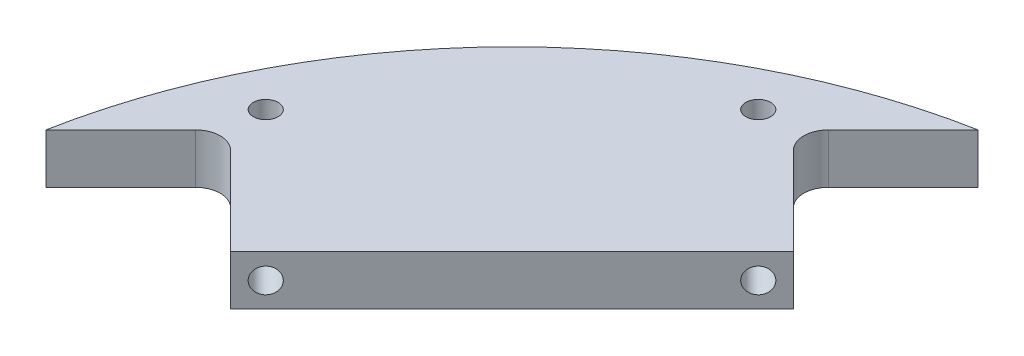
ISO-10303-21;
HEADER;
FILE_DESCRIPTION(('STEP AP214'),'2;1');
FILE_NAME('part.step','',(''),(''),'','','');
FILE_SCHEMA(('AUTOMOTIVE_DESIGN { 1 0 10303 214 1 1 1 1 }'));
ENDSEC;
DATA;
#1=APPLICATION_CONTEXT('core data for automotive mechanical design processes');
#2=APPLICATION_PROTOCOL_DEFINITION('international standard','automotive_design',2000,#1);
#3=PRODUCT_CONTEXT('',#1,'mechanical');
#4=PRODUCT('Part','Part','',(#3));
#5=PRODUCT_RELATED_PRODUCT_CATEGORY('part','',(#4));
#6=PRODUCT_DEFINITION_FORMATION('','',#4);
#7=PRODUCT_DEFINITION_CONTEXT('part definition',#1,'design');
#8=PRODUCT_DEFINITION('design','',#6,#7);
#9=PRODUCT_DEFINITION_SHAPE('','',#8);
#10=(LENGTH_UNIT() NAMED_UNIT(*) SI_UNIT(.MILLI.,.METRE.));
#11=(NAMED_UNIT(*) PLANE_ANGLE_UNIT() SI_UNIT($,.RADIAN.));
#12=(NAMED_UNIT(*) SI_UNIT($,.STERADIAN.) SOLID_ANGLE_UNIT());
#13=UNCERTAINTY_MEASURE_WITH_UNIT(LENGTH_MEASURE(1.E-05),#10,'distance_accuracy_value','');
#14=(GEOMETRIC_REPRESENTATION_CONTEXT(3) GLOBAL_UNCERTAINTY_ASSIGNED_CONTEXT((#13)) GLOBAL_UNIT_ASSIGNED_CONTEXT((#10,
#11,#12)) REPRESENTATION_CONTEXT('',''));
#15=CARTESIAN_POINT('',(0.,0.,0.));
#16=DIRECTION('',(0.,0.,1.));
#17=DIRECTION('',(1.,0.,0.));
#18=AXIS2_PLACEMENT_3D('',#15,#16,#17);
#19=CARTESIAN_POINT('',(-24.2966489706747,12.7,-96.138697939228));
#20=DIRECTION('',(0.707106781186548,0.,0.707106781186547));
#21=DIRECTION('',(0.707106781186547,0.,-0.707106781186548));
#22=AXIS2_PLACEMENT_3D('',#19,#20,#21);
#23=PLANE('',#22);
#24=CARTESIAN_POINT('',(-91.6485698786934,6.35,-28.7867770312093));
#25=DIRECTION('',(-0.707106781186548,0.,-0.707106781186547));
#26=DIRECTION('',(-0.707106781186547,0.,0.707106781186548));
#27=AXIS2_PLACEMENT_3D('',#24,#25,#26);
#28=CIRCLE('',#27,3.17499999999999);
#29=CARTESIAN_POINT('',(-93.8936339089607,6.35,-26.541713000942));
#30=VERTEX_POINT('',#29);
#31=EDGE_CURVE('E245',#30,#30,#28,.T.);
#32=ORIENTED_EDGE('',*,*,#31,.T.);
#33=EDGE_LOOP('',(#32));
#34=FACE_BOUND('',#33,.T.);
#35=DIRECTION('',(-0.707106781186547,0.,0.707106781186548));
#36=VECTOR('',#35,1.);
#37=CARTESIAN_POINT('',(-24.2966489706747,0.,-96.138697939228));
#38=LINE('',#37,#36);
#39=CARTESIAN_POINT('',(-24.2966489706747,0.,-96.138697939228));
#40=VERTEX_POINT('',#39);
#41=CARTESIAN_POINT('',(-96.1386979392279,0.,-24.2966489706747));
#42=VERTEX_POINT('',#41);
#43=EDGE_CURVE('E150',#40,#42,#38,.T.);
#44=ORIENTED_EDGE('',*,*,#43,.F.);
#45=DIRECTION('',(0.,-1.,0.));
#46=VECTOR('',#45,1.);
#47=CARTESIAN_POINT('',(-24.2966489706747,12.7,-96.138697939228));
#48=LINE('',#47,#46);
#49=CARTESIAN_POINT('',(-24.2966489706747,12.7,-96.138697939228));
#50=VERTEX_POINT('',#49);
#51=EDGE_CURVE('E112',#50,#40,#48,.T.);
#52=ORIENTED_EDGE('',*,*,#51,.F.);
#53=DIRECTION('',(-0.707106781186547,0.,0.707106781186548));
#54=VECTOR('',#53,1.);
#55=CARTESIAN_POINT('',(-24.2966489706747,12.7,-96.138697939228));
#56=LINE('',#55,#54);
#57=CARTESIAN_POINT('',(-96.1386979392279,12.7,-24.2966489706747));
#58=VERTEX_POINT('',#57);
#59=EDGE_CURVE('E137',#50,#58,#56,.T.);
#60=ORIENTED_EDGE('',*,*,#59,.T.);
#61=DIRECTION('',(0.,-1.,0.));
#62=VECTOR('',#61,1.);
#63=CARTESIAN_POINT('',(-96.1386979392279,12.7,-24.2966489706747));
#64=LINE('',#63,#62);
#65=EDGE_CURVE('E157',#58,#42,#64,.T.);
#66=ORIENTED_EDGE('',*,*,#65,.T.);
#67=EDGE_LOOP('',(#44,#52,#60,#66));
#68=FACE_BOUND('',#67,.T.);
#69=CARTESIAN_POINT('',(-28.7867770312093,6.35,-91.6485698786934));
#70=DIRECTION('',(0.707106781186548,0.,0.707106781186547));
#71=DIRECTION('',(0.707106781186547,0.,-0.707106781186548));
#72=AXIS2_PLACEMENT_3D('',#69,#70,#71);
#73=CIRCLE('',#72,3.175);
#74=CARTESIAN_POINT('',(-26.5417130009421,6.35,-93.8936339089607));
#75=VERTEX_POINT('',#74);
#76=EDGE_CURVE('E240',#75,#75,#73,.T.);
#77=ORIENTED_EDGE('',*,*,#76,.F.);
#78=EDGE_LOOP('',(#77));
#79=FACE_BOUND('',#78,.T.);
#80=ADVANCED_FACE('F36',(#34,#68,#79),#23,.T.);
#81=CARTESIAN_POINT('',(0.,12.7,0.));
#82=DIRECTION('',(0.,-1.,0.));
#83=DIRECTION('',(0.,0.,-1.));
#84=AXIS2_PLACEMENT_3D('',#81,#82,#83);
#85=PLANE('',#84);
#86=CARTESIAN_POINT('',(0.,12.7,0.));
#87=DIRECTION('',(0.,-1.,0.));
#88=DIRECTION('',(0.,0.,-1.));
#89=AXIS2_PLACEMENT_3D('',#86,#87,#88);
#90=CIRCLE('',#89,149.225);
#91=CARTESIAN_POINT('',(-146.634960986068,12.7,-27.68192265025));
#92=VERTEX_POINT('',#91);
#93=CARTESIAN_POINT('',(-27.68192265025,12.7,-146.634960986068));
#94=VERTEX_POINT('',#93);
#95=EDGE_CURVE('E120',#92,#94,#90,.T.);
#96=ORIENTED_EDGE('',*,*,#95,.F.);
#97=DIRECTION('',(0.707106781186548,0.,-0.707106781186547));
#98=VECTOR('',#97,1.);
#99=CARTESIAN_POINT('',(-146.634960986068,12.7,-27.68192265025));
#100=LINE('',#99,#98);
#101=CARTESIAN_POINT('',(-127.56959436297,12.7,-46.7472892733476));
#102=VERTEX_POINT('',#101);
#103=EDGE_CURVE('E113',#92,#102,#100,.T.);
#104=ORIENTED_EDGE('',*,*,#103,.T.);
#105=CARTESIAN_POINT('',(-123.079466302435,12.7,-42.257161212813));
#106=DIRECTION('',(0.,-1.,0.));
#107=DIRECTION('',(0.,0.,-1.));
#108=AXIS2_PLACEMENT_3D('',#105,#106,#107);
#109=CIRCLE('',#108,6.35);
#110=CARTESIAN_POINT('',(-118.589338241901,12.7,-46.7472892733476));
#111=VERTEX_POINT('',#110);
#112=EDGE_CURVE('E169',#102,#111,#109,.T.);
#113=ORIENTED_EDGE('',*,*,#112,.T.);
#114=DIRECTION('',(-0.707106781186547,0.,-0.707106781186548));
#115=VECTOR('',#114,1.);
#116=CARTESIAN_POINT('',(-96.1386979392279,12.7,-24.2966489706747));
#117=LINE('',#116,#115);
#118=EDGE_CURVE('E140',#58,#111,#117,.T.);
#119=ORIENTED_EDGE('',*,*,#118,.F.);
#120=ORIENTED_EDGE('',*,*,#59,.F.);
#121=DIRECTION('',(-0.707106781186548,0.,-0.707106781186547));
#122=VECTOR('',#121,1.);
#123=CARTESIAN_POINT('',(-24.2966489706747,12.7,-96.138697939228));
#124=LINE('',#123,#122);
#125=CARTESIAN_POINT('',(-46.7472892733476,12.7,-118.589338241901));
#126=VERTEX_POINT('',#125);
#127=EDGE_CURVE('E122',#50,#126,#124,.T.);
#128=ORIENTED_EDGE('',*,*,#127,.T.);
#129=CARTESIAN_POINT('',(-42.2571612128131,12.7,-123.079466302435));
#130=DIRECTION('',(0.,-1.,0.));
#131=DIRECTION('',(0.,0.,-1.));
#132=AXIS2_PLACEMENT_3D('',#129,#130,#131);
#133=CIRCLE('',#132,6.35);
#134=CARTESIAN_POINT('',(-46.7472892733477,12.7,-127.56959436297));
#135=VERTEX_POINT('',#134);
#136=EDGE_CURVE('E11',#126,#135,#133,.T.);
#137=ORIENTED_EDGE('',*,*,#136,.T.);
#138=DIRECTION('',(-0.707106781186547,0.,0.707106781186548));
#139=VECTOR('',#138,1.);
#140=CARTESIAN_POINT('',(-27.68192265025,12.7,-146.634960986068));
#141=LINE('',#140,#139);
#142=EDGE_CURVE('E105',#94,#135,#141,.T.);
#143=ORIENTED_EDGE('',*,*,#142,.F.);
#144=EDGE_LOOP('',(#96,#104,#113,#119,#120,#128,#137,#143));
#145=FACE_BOUND('',#144,.T.);
#146=CARTESIAN_POINT('',(-123.079466302435,12.7,-60.2176734549513));
#147=DIRECTION('',(0.,1.,0.));
#148=DIRECTION('',(0.,0.,1.));
#149=AXIS2_PLACEMENT_3D('',#146,#147,#148);
#150=CIRCLE('',#149,3.175);
#151=CARTESIAN_POINT('',(-123.079466302435,12.7,-57.0426734549513));
#152=VERTEX_POINT('',#151);
#153=EDGE_CURVE('E235',#152,#152,#150,.F.);
#154=ORIENTED_EDGE('',*,*,#153,.T.);
#155=EDGE_LOOP('',(#154));
#156=FACE_BOUND('',#155,.T.);
#157=CARTESIAN_POINT('',(-60.2176734549514,12.7,-123.079466302435));
#158=DIRECTION('',(0.,1.,0.));
#159=DIRECTION('',(0.,0.,1.));
#160=AXIS2_PLACEMENT_3D('',#157,#158,#159);
#161=CIRCLE('',#160,3.175);
#162=CARTESIAN_POINT('',(-60.2176734549514,12.7,-119.904466302435));
#163=VERTEX_POINT('',#162);
#164=EDGE_CURVE('E238',#163,#163,#161,.T.);
#165=ORIENTED_EDGE('',*,*,#164,.F.);
#166=EDGE_LOOP('',(#165));
#167=FACE_BOUND('',#166,.T.);
#168=ADVANCED_FACE('F117',(#145,#156,#167),#85,.F.);
#169=CARTESIAN_POINT('',(0.,0.,0.));
#170=DIRECTION('',(0.,-1.,0.));
#171=DIRECTION('',(0.,0.,-1.));
#172=AXIS2_PLACEMENT_3D('',#169,#170,#171);
#173=PLANE('',#172);
#174=CARTESIAN_POINT('',(-123.079466302435,0.,-60.2176734549513));
#175=DIRECTION('',(0.,1.,0.));
#176=DIRECTION('',(0.,0.,1.));
#177=AXIS2_PLACEMENT_3D('',#174,#175,#176);
#178=CIRCLE('',#177,3.175);
#179=CARTESIAN_POINT('',(-123.079466302435,0.,-57.0426734549513));
#180=VERTEX_POINT('',#179);
#181=EDGE_CURVE('E133',#180,#180,#178,.F.);
#182=ORIENTED_EDGE('',*,*,#181,.F.);
#183=EDGE_LOOP('',(#182));
#184=FACE_BOUND('',#183,.T.);
#185=CARTESIAN_POINT('',(0.,0.,0.));
#186=DIRECTION('',(0.,-1.,0.));
#187=DIRECTION('',(0.,0.,-1.));
#188=AXIS2_PLACEMENT_3D('',#185,#186,#187);
#189=CIRCLE('',#188,149.225);
#190=CARTESIAN_POINT('',(-146.634960986068,0.,-27.68192265025));
#191=VERTEX_POINT('',#190);
#192=CARTESIAN_POINT('',(-27.68192265025,0.,-146.634960986068));
#193=VERTEX_POINT('',#192);
#194=EDGE_CURVE('E144',#191,#193,#189,.T.);
#195=ORIENTED_EDGE('',*,*,#194,.T.);
#196=DIRECTION('',(-0.707106781186547,0.,0.707106781186548));
#197=VECTOR('',#196,1.);
#198=CARTESIAN_POINT('',(-27.68192265025,0.,-146.634960986068));
#199=LINE('',#198,#197);
#200=CARTESIAN_POINT('',(-46.7472892733477,0.,-127.56959436297));
#201=VERTEX_POINT('',#200);
#202=EDGE_CURVE('E107',#193,#201,#199,.T.);
#203=ORIENTED_EDGE('',*,*,#202,.T.);
#204=CARTESIAN_POINT('',(-42.2571612128131,0.,-123.079466302435));
#205=DIRECTION('',(0.,-1.,0.));
#206=DIRECTION('',(0.,0.,-1.));
#207=AXIS2_PLACEMENT_3D('',#204,#205,#206);
#208=CIRCLE('',#207,6.35);
#209=CARTESIAN_POINT('',(-46.7472892733476,0.,-118.589338241901));
#210=VERTEX_POINT('',#209);
#211=EDGE_CURVE('E44',#201,#210,#208,.F.);
#212=ORIENTED_EDGE('',*,*,#211,.T.);
#213=DIRECTION('',(-0.707106781186548,0.,-0.707106781186547));
#214=VECTOR('',#213,1.);
#215=CARTESIAN_POINT('',(-24.2966489706747,0.,-96.138697939228));
#216=LINE('',#215,#214);
#217=EDGE_CURVE('E148',#40,#210,#216,.T.);
#218=ORIENTED_EDGE('',*,*,#217,.F.);
#219=ORIENTED_EDGE('',*,*,#43,.T.);
#220=DIRECTION('',(-0.707106781186547,0.,-0.707106781186548));
#221=VECTOR('',#220,1.);
#222=CARTESIAN_POINT('',(-96.1386979392279,0.,-24.2966489706747));
#223=LINE('',#222,#221);
#224=CARTESIAN_POINT('',(-118.589338241901,0.,-46.7472892733476));
#225=VERTEX_POINT('',#224);
#226=EDGE_CURVE('E130',#42,#225,#223,.T.);
#227=ORIENTED_EDGE('',*,*,#226,.T.);
#228=CARTESIAN_POINT('',(-123.079466302435,0.,-42.257161212813));
#229=DIRECTION('',(0.,-1.,0.));
#230=DIRECTION('',(0.,0.,-1.));
#231=AXIS2_PLACEMENT_3D('',#228,#229,#230);
#232=CIRCLE('',#231,6.35);
#233=CARTESIAN_POINT('',(-127.56959436297,0.,-46.7472892733476));
#234=VERTEX_POINT('',#233);
#235=EDGE_CURVE('E167',#225,#234,#232,.F.);
#236=ORIENTED_EDGE('',*,*,#235,.T.);
#237=DIRECTION('',(0.707106781186548,0.,-0.707106781186547));
#238=VECTOR('',#237,1.);
#239=CARTESIAN_POINT('',(-146.634960986068,0.,-27.68192265025));
#240=LINE('',#239,#238);
#241=EDGE_CURVE('E127',#191,#234,#240,.T.);
#242=ORIENTED_EDGE('',*,*,#241,.F.);
#243=EDGE_LOOP('',(#195,#203,#212,#218,#219,#227,#236,#242));
#244=FACE_BOUND('',#243,.T.);
#245=CARTESIAN_POINT('',(-60.2176734549514,0.,-123.079466302435));
#246=DIRECTION('',(0.,1.,0.));
#247=DIRECTION('',(0.,0.,1.));
#248=AXIS2_PLACEMENT_3D('',#245,#246,#247);
#249=CIRCLE('',#248,3.175);
#250=CARTESIAN_POINT('',(-60.2176734549514,0.,-119.904466302435));
#251=VERTEX_POINT('',#250);
#252=EDGE_CURVE('E146',#251,#251,#249,.T.);
#253=ORIENTED_EDGE('',*,*,#252,.T.);
#254=EDGE_LOOP('',(#253));
#255=FACE_BOUND('',#254,.T.);
#256=ADVANCED_FACE('F181',(#184,#244,#255),#173,.T.);
#257=CARTESIAN_POINT('',(0.,12.7,0.));
#258=DIRECTION('',(0.,-1.,0.));
#259=DIRECTION('',(0.,0.,-1.));
#260=AXIS2_PLACEMENT_3D('',#257,#258,#259);
#261=CYLINDRICAL_SURFACE('',#260,149.225);
#262=ORIENTED_EDGE('',*,*,#194,.F.);
#263=DIRECTION('',(0.,-1.,0.));
#264=VECTOR('',#263,1.);
#265=CARTESIAN_POINT('',(-146.634960986068,12.7,-27.68192265025));
#266=LINE('',#265,#264);
#267=EDGE_CURVE('E125',#92,#191,#266,.T.);
#268=ORIENTED_EDGE('',*,*,#267,.F.);
#269=ORIENTED_EDGE('',*,*,#95,.T.);
#270=DIRECTION('',(0.,-1.,0.));
#271=VECTOR('',#270,1.);
#272=CARTESIAN_POINT('',(-27.68192265025,12.7,-146.634960986068));
#273=LINE('',#272,#271);
#274=EDGE_CURVE('E101',#94,#193,#273,.T.);
#275=ORIENTED_EDGE('',*,*,#274,.T.);
#276=EDGE_LOOP('',(#262,#268,#269,#275));
#277=FACE_BOUND('',#276,.T.);
#278=ADVANCED_FACE('F124',(#277),#261,.T.);
#279=CARTESIAN_POINT('',(-146.634960986068,12.7,-27.68192265025));
#280=DIRECTION('',(-0.707106781186547,0.,-0.707106781186548));
#281=DIRECTION('',(-0.707106781186548,0.,0.707106781186547));
#282=AXIS2_PLACEMENT_3D('',#279,#280,#281);
#283=PLANE('',#282);
#284=ORIENTED_EDGE('',*,*,#241,.T.);
#285=DIRECTION('',(0.,-1.,0.));
#286=VECTOR('',#285,1.);
#287=CARTESIAN_POINT('',(-127.56959436297,12.7,-46.7472892733476));
#288=LINE('',#287,#286);
#289=EDGE_CURVE('E162',#234,#102,#288,.F.);
#290=ORIENTED_EDGE('',*,*,#289,.T.);
#291=ORIENTED_EDGE('',*,*,#103,.F.);
#292=ORIENTED_EDGE('',*,*,#267,.T.);
#293=EDGE_LOOP('',(#284,#290,#291,#292));
#294=FACE_BOUND('',#293,.T.);
#295=ADVANCED_FACE('F184',(#294),#283,.F.);
#296=CARTESIAN_POINT('',(-96.1386979392279,12.7,-24.2966489706747));
#297=DIRECTION('',(-0.707106781186548,0.,0.707106781186547));
#298=DIRECTION('',(0.707106781186547,0.,0.707106781186548));
#299=AXIS2_PLACEMENT_3D('',#296,#297,#298);
#300=PLANE('',#299);
#301=ORIENTED_EDGE('',*,*,#118,.T.);
#302=DIRECTION('',(0.,-1.,0.));
#303=VECTOR('',#302,1.);
#304=CARTESIAN_POINT('',(-118.589338241901,12.7,-46.7472892733476));
#305=LINE('',#304,#303);
#306=EDGE_CURVE('E156',#111,#225,#305,.T.);
#307=ORIENTED_EDGE('',*,*,#306,.T.);
#308=ORIENTED_EDGE('',*,*,#226,.F.);
#309=ORIENTED_EDGE('',*,*,#65,.F.);
#310=EDGE_LOOP('',(#301,#307,#308,#309));
#311=FACE_BOUND('',#310,.T.);
#312=ADVANCED_FACE('F177',(#311),#300,.T.);
#313=CARTESIAN_POINT('',(-24.2966489706747,12.7,-96.138697939228));
#314=DIRECTION('',(-0.707106781186547,0.,0.707106781186548));
#315=DIRECTION('',(0.707106781186548,0.,0.707106781186547));
#316=AXIS2_PLACEMENT_3D('',#313,#314,#315);
#317=PLANE('',#316);
#318=ORIENTED_EDGE('',*,*,#217,.T.);
#319=DIRECTION('',(0.,-1.,0.));
#320=VECTOR('',#319,1.);
#321=CARTESIAN_POINT('',(-46.7472892733476,12.7,-118.589338241901));
#322=LINE('',#321,#320);
#323=EDGE_CURVE('E51',#210,#126,#322,.F.);
#324=ORIENTED_EDGE('',*,*,#323,.T.);
#325=ORIENTED_EDGE('',*,*,#127,.F.);
#326=ORIENTED_EDGE('',*,*,#51,.T.);
#327=EDGE_LOOP('',(#318,#324,#325,#326));
#328=FACE_BOUND('',#327,.T.);
#329=ADVANCED_FACE('F191',(#328),#317,.F.);
#330=CARTESIAN_POINT('',(-27.68192265025,12.7,-146.634960986068));
#331=DIRECTION('',(0.707106781186548,0.,0.707106781186547));
#332=DIRECTION('',(0.707106781186547,0.,-0.707106781186548));
#333=AXIS2_PLACEMENT_3D('',#330,#331,#332);
#334=PLANE('',#333);
#335=ORIENTED_EDGE('',*,*,#142,.T.);
#336=DIRECTION('',(0.,-1.,0.));
#337=VECTOR('',#336,1.);
#338=CARTESIAN_POINT('',(-46.7472892733476,12.7,-127.56959436297));
#339=LINE('',#338,#337);
#340=EDGE_CURVE('E164',#135,#201,#339,.T.);
#341=ORIENTED_EDGE('',*,*,#340,.T.);
#342=ORIENTED_EDGE('',*,*,#202,.F.);
#343=ORIENTED_EDGE('',*,*,#274,.F.);
#344=EDGE_LOOP('',(#335,#341,#342,#343));
#345=FACE_BOUND('',#344,.T.);
#346=ADVANCED_FACE('F103',(#345),#334,.T.);
#347=CARTESIAN_POINT('',(-123.079466302435,0.,-60.2176734549513));
#348=DIRECTION('',(0.,1.,0.));
#349=DIRECTION('',(0.,0.,1.));
#350=AXIS2_PLACEMENT_3D('',#347,#348,#349);
#351=CYLINDRICAL_SURFACE('',#350,3.175);
#352=ORIENTED_EDGE('',*,*,#181,.T.);
#353=EDGE_LOOP('',(#352));
#354=FACE_BOUND('',#353,.T.);
#355=ORIENTED_EDGE('',*,*,#153,.F.);
#356=EDGE_LOOP('',(#355));
#357=FACE_BOUND('',#356,.T.);
#358=ADVANCED_FACE('F208',(#354,#357),#351,.F.);
#359=CARTESIAN_POINT('',(-60.2176734549514,0.,-123.079466302435));
#360=DIRECTION('',(0.,1.,0.));
#361=DIRECTION('',(0.,0.,1.));
#362=AXIS2_PLACEMENT_3D('',#359,#360,#361);
#363=CYLINDRICAL_SURFACE('',#362,3.175);
#364=ORIENTED_EDGE('',*,*,#252,.F.);
#365=EDGE_LOOP('',(#364));
#366=FACE_BOUND('',#365,.T.);
#367=ORIENTED_EDGE('',*,*,#164,.T.);
#368=EDGE_LOOP('',(#367));
#369=FACE_BOUND('',#368,.T.);
#370=ADVANCED_FACE('F210',(#366,#369),#363,.F.);
#371=CARTESIAN_POINT('',(-123.079466302435,12.7,-42.257161212813));
#372=DIRECTION('',(0.,-1.,0.));
#373=DIRECTION('',(0.,0.,-1.));
#374=AXIS2_PLACEMENT_3D('',#371,#372,#373);
#375=CYLINDRICAL_SURFACE('',#374,6.35);
#376=ORIENTED_EDGE('',*,*,#112,.F.);
#377=ORIENTED_EDGE('',*,*,#289,.F.);
#378=ORIENTED_EDGE('',*,*,#235,.F.);
#379=ORIENTED_EDGE('',*,*,#306,.F.);
#380=EDGE_LOOP('',(#376,#377,#378,#379));
#381=FACE_BOUND('',#380,.T.);
#382=ADVANCED_FACE('F179',(#381),#375,.F.);
#383=CARTESIAN_POINT('',(-42.2571612128131,12.7,-123.079466302435));
#384=DIRECTION('',(0.,-1.,0.));
#385=DIRECTION('',(0.,0.,-1.));
#386=AXIS2_PLACEMENT_3D('',#383,#384,#385);
#387=CYLINDRICAL_SURFACE('',#386,6.35);
#388=ORIENTED_EDGE('',*,*,#136,.F.);
#389=ORIENTED_EDGE('',*,*,#323,.F.);
#390=ORIENTED_EDGE('',*,*,#211,.F.);
#391=ORIENTED_EDGE('',*,*,#340,.F.);
#392=EDGE_LOOP('',(#388,#389,#390,#391));
#393=FACE_BOUND('',#392,.T.);
#394=ADVANCED_FACE('F38',(#393),#387,.F.);
#395=CARTESIAN_POINT('',(-100.628825999763,6.35,-37.7670331522785));
#396=DIRECTION('',(0.707106781186548,0.,0.707106781186547));
#397=DIRECTION('',(0.707106781186547,0.,-0.707106781186548));
#398=AXIS2_PLACEMENT_3D('',#395,#396,#397);
#399=CYLINDRICAL_SURFACE('',#398,3.17499999999999);
#400=CARTESIAN_POINT('',(-100.628825999763,6.35,-37.7670331522785));
#401=DIRECTION('',(-0.707106781186548,0.,-0.707106781186547));
#402=DIRECTION('',(-0.707106781186547,0.,0.707106781186548));
#403=AXIS2_PLACEMENT_3D('',#400,#401,#402);
#404=CIRCLE('',#403,3.17499999999999);
#405=CARTESIAN_POINT('',(-102.87389003003,6.35,-35.5219691220112));
#406=VERTEX_POINT('',#405);
#407=EDGE_CURVE('E249',#406,#406,#404,.T.);
#408=ORIENTED_EDGE('',*,*,#407,.T.);
#409=EDGE_LOOP('',(#408));
#410=FACE_BOUND('',#409,.T.);
#411=ORIENTED_EDGE('',*,*,#31,.F.);
#412=EDGE_LOOP('',(#411));
#413=FACE_BOUND('',#412,.T.);
#414=ADVANCED_FACE('F215',(#410,#413),#399,.F.);
#415=CARTESIAN_POINT('',(-100.628825999763,6.35,-37.7670331522785));
#416=DIRECTION('',(-0.707106781186548,0.,-0.707106781186547));
#417=DIRECTION('',(-0.707106781186547,0.,0.707106781186548));
#418=AXIS2_PLACEMENT_3D('',#415,#416,#417);
#419=PLANE('',#418);
#420=ORIENTED_EDGE('',*,*,#407,.F.);
#421=EDGE_LOOP('',(#420));
#422=FACE_BOUND('',#421,.T.);
#423=ADVANCED_FACE('F227',(#422),#419,.F.);
#424=CARTESIAN_POINT('',(-37.7670331522785,6.35,-100.628825999763));
#425=DIRECTION('',(0.707106781186548,0.,0.707106781186547));
#426=DIRECTION('',(0.707106781186547,0.,-0.707106781186548));
#427=AXIS2_PLACEMENT_3D('',#424,#425,#426);
#428=CYLINDRICAL_SURFACE('',#427,3.175);
#429=CARTESIAN_POINT('',(-37.7670331522785,6.35,-100.628825999763));
#430=DIRECTION('',(0.707106781186548,0.,0.707106781186547));
#431=DIRECTION('',(0.707106781186547,0.,-0.707106781186548));
#432=AXIS2_PLACEMENT_3D('',#429,#430,#431);
#433=CIRCLE('',#432,3.175);
#434=CARTESIAN_POINT('',(-35.5219691220112,6.35,-102.87389003003));
#435=VERTEX_POINT('',#434);
#436=EDGE_CURVE('E236',#435,#435,#433,.T.);
#437=ORIENTED_EDGE('',*,*,#436,.F.);
#438=EDGE_LOOP('',(#437));
#439=FACE_BOUND('',#438,.T.);
#440=ORIENTED_EDGE('',*,*,#76,.T.);
#441=EDGE_LOOP('',(#440));
#442=FACE_BOUND('',#441,.T.);
#443=ADVANCED_FACE('F262',(#439,#442),#428,.F.);
#444=CARTESIAN_POINT('',(-37.7670331522785,6.35,-100.628825999763));
#445=DIRECTION('',(0.707106781186548,0.,0.707106781186547));
#446=DIRECTION('',(0.707106781186547,0.,-0.707106781186548));
#447=AXIS2_PLACEMENT_3D('',#444,#445,#446);
#448=PLANE('',#447);
#449=ORIENTED_EDGE('',*,*,#436,.T.);
#450=EDGE_LOOP('',(#449));
#451=FACE_BOUND('',#450,.T.);
#452=ADVANCED_FACE('F267',(#451),#448,.T.);
#453=CLOSED_SHELL('',(#80,#168,#256,#278,#295,#312,#329,#346,#358,#370,#382,#394,#414,#423,#443,#452));
#454=MANIFOLD_SOLID_BREP('B2',#453);
#455=ADVANCED_BREP_SHAPE_REPRESENTATION('',(#18,#454),#14);
#456=SHAPE_DEFINITION_REPRESENTATION(#9,#455);
ENDSEC;
END-ISO-10303-21;
